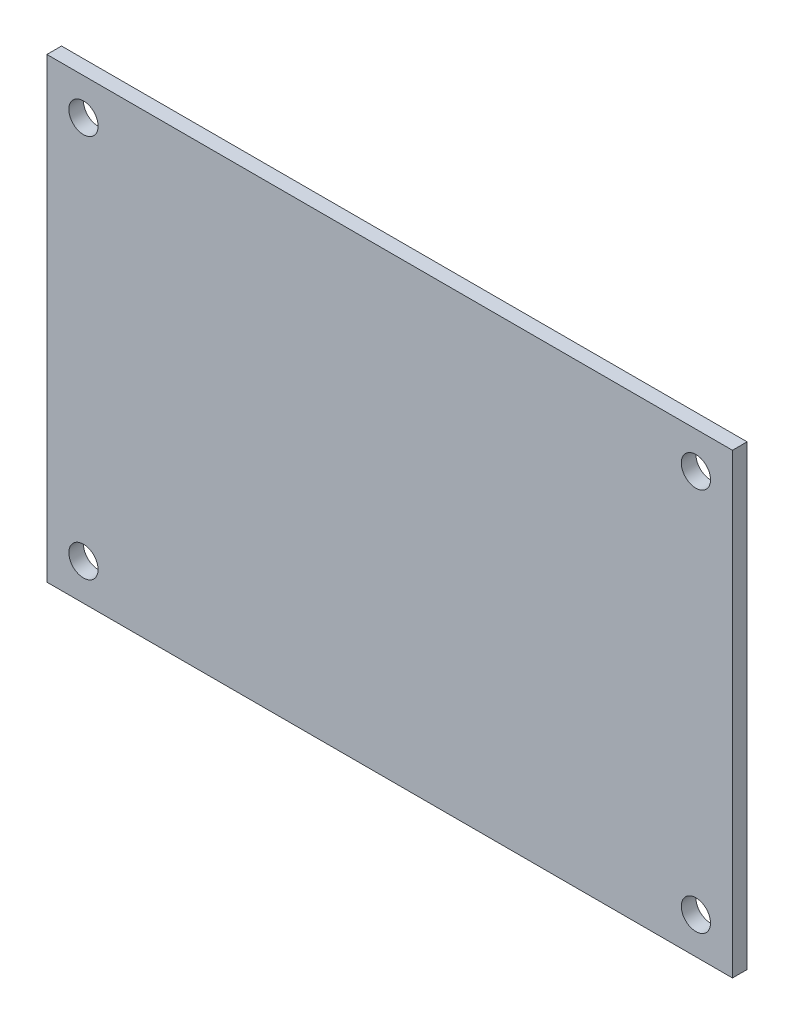
ISO-10303-21;
HEADER;
FILE_DESCRIPTION(('STEP AP214'),'2;1');
FILE_NAME('part.step','',(''),(''),'','','');
FILE_SCHEMA(('AUTOMOTIVE_DESIGN { 1 0 10303 214 1 1 1 1 }'));
ENDSEC;
DATA;
#1=APPLICATION_CONTEXT('core data for automotive mechanical design processes');
#2=APPLICATION_PROTOCOL_DEFINITION('international standard','automotive_design',2000,#1);
#3=PRODUCT_CONTEXT('',#1,'mechanical');
#4=PRODUCT('Part','Part','',(#3));
#5=PRODUCT_RELATED_PRODUCT_CATEGORY('part','',(#4));
#6=PRODUCT_DEFINITION_FORMATION('','',#4);
#7=PRODUCT_DEFINITION_CONTEXT('part definition',#1,'design');
#8=PRODUCT_DEFINITION('design','',#6,#7);
#9=PRODUCT_DEFINITION_SHAPE('','',#8);
#10=(LENGTH_UNIT() NAMED_UNIT(*) SI_UNIT(.MILLI.,.METRE.));
#11=(NAMED_UNIT(*) PLANE_ANGLE_UNIT() SI_UNIT($,.RADIAN.));
#12=(NAMED_UNIT(*) SI_UNIT($,.STERADIAN.) SOLID_ANGLE_UNIT());
#13=UNCERTAINTY_MEASURE_WITH_UNIT(LENGTH_MEASURE(1.E-05),#10,'distance_accuracy_value','');
#14=(GEOMETRIC_REPRESENTATION_CONTEXT(3) GLOBAL_UNCERTAINTY_ASSIGNED_CONTEXT((#13)) GLOBAL_UNIT_ASSIGNED_CONTEXT((#10,
#11,#12)) REPRESENTATION_CONTEXT('',''));
#15=CARTESIAN_POINT('',(0.,0.,0.));
#16=DIRECTION('',(0.,0.,1.));
#17=DIRECTION('',(1.,0.,0.));
#18=AXIS2_PLACEMENT_3D('',#15,#16,#17);
#19=CARTESIAN_POINT('',(-37.5,25.,1.6));
#20=DIRECTION('',(1.,0.,0.));
#21=DIRECTION('',(0.,1.,0.));
#22=AXIS2_PLACEMENT_3D('',#19,#20,#21);
#23=PLANE('',#22);
#24=DIRECTION('',(0.,-1.,0.));
#25=VECTOR('',#24,1.);
#26=CARTESIAN_POINT('',(-37.5,25.,0.));
#27=LINE('',#26,#25);
#28=CARTESIAN_POINT('',(-37.5,25.,0.));
#29=VERTEX_POINT('',#28);
#30=CARTESIAN_POINT('',(-37.5,-25.,0.));
#31=VERTEX_POINT('',#30);
#32=EDGE_CURVE('E96',#29,#31,#27,.T.);
#33=ORIENTED_EDGE('',*,*,#32,.T.);
#34=DIRECTION('',(0.,0.,-1.));
#35=VECTOR('',#34,1.);
#36=CARTESIAN_POINT('',(-37.5,-25.,1.6));
#37=LINE('',#36,#35);
#38=CARTESIAN_POINT('',(-37.5,-25.,1.6));
#39=VERTEX_POINT('',#38);
#40=EDGE_CURVE('E11',#39,#31,#37,.T.);
#41=ORIENTED_EDGE('',*,*,#40,.F.);
#42=DIRECTION('',(0.,-1.,0.));
#43=VECTOR('',#42,1.);
#44=CARTESIAN_POINT('',(-37.5,25.,1.6));
#45=LINE('',#44,#43);
#46=CARTESIAN_POINT('',(-37.5,25.,1.6));
#47=VERTEX_POINT('',#46);
#48=EDGE_CURVE('E84',#47,#39,#45,.T.);
#49=ORIENTED_EDGE('',*,*,#48,.F.);
#50=DIRECTION('',(0.,0.,-1.));
#51=VECTOR('',#50,1.);
#52=CARTESIAN_POINT('',(-37.5,25.,1.6));
#53=LINE('',#52,#51);
#54=EDGE_CURVE('E92',#47,#29,#53,.T.);
#55=ORIENTED_EDGE('',*,*,#54,.T.);
#56=EDGE_LOOP('',(#33,#41,#49,#55));
#57=FACE_BOUND('',#56,.T.);
#58=ADVANCED_FACE('F33',(#57),#23,.F.);
#59=CARTESIAN_POINT('',(-37.5,-25.,1.6));
#60=DIRECTION('',(0.,1.,0.));
#61=DIRECTION('',(0.,0.,1.));
#62=AXIS2_PLACEMENT_3D('',#59,#60,#61);
#63=PLANE('',#62);
#64=DIRECTION('',(1.,0.,0.));
#65=VECTOR('',#64,1.);
#66=CARTESIAN_POINT('',(-37.5,-25.,0.));
#67=LINE('',#66,#65);
#68=CARTESIAN_POINT('',(37.5,-25.,0.));
#69=VERTEX_POINT('',#68);
#70=EDGE_CURVE('E88',#31,#69,#67,.T.);
#71=ORIENTED_EDGE('',*,*,#70,.T.);
#72=DIRECTION('',(0.,0.,-1.));
#73=VECTOR('',#72,1.);
#74=CARTESIAN_POINT('',(37.5,-25.,1.6));
#75=LINE('',#74,#73);
#76=CARTESIAN_POINT('',(37.5,-25.,1.6));
#77=VERTEX_POINT('',#76);
#78=EDGE_CURVE('E41',#77,#69,#75,.T.);
#79=ORIENTED_EDGE('',*,*,#78,.F.);
#80=DIRECTION('',(1.,0.,0.));
#81=VECTOR('',#80,1.);
#82=CARTESIAN_POINT('',(-37.5,-25.,1.6));
#83=LINE('',#82,#81);
#84=EDGE_CURVE('E79',#39,#77,#83,.T.);
#85=ORIENTED_EDGE('',*,*,#84,.F.);
#86=ORIENTED_EDGE('',*,*,#40,.T.);
#87=EDGE_LOOP('',(#71,#79,#85,#86));
#88=FACE_BOUND('',#87,.T.);
#89=ADVANCED_FACE('F87',(#88),#63,.F.);
#90=CARTESIAN_POINT('',(37.5,25.,1.6));
#91=DIRECTION('',(-1.,0.,0.));
#92=DIRECTION('',(0.,0.,1.));
#93=AXIS2_PLACEMENT_3D('',#90,#91,#92);
#94=PLANE('',#93);
#95=DIRECTION('',(0.,1.,0.));
#96=VECTOR('',#95,1.);
#97=CARTESIAN_POINT('',(37.5,25.,0.));
#98=LINE('',#97,#96);
#99=CARTESIAN_POINT('',(37.5,25.,0.));
#100=VERTEX_POINT('',#99);
#101=EDGE_CURVE('E66',#69,#100,#98,.T.);
#102=ORIENTED_EDGE('',*,*,#101,.T.);
#103=DIRECTION('',(0.,0.,-1.));
#104=VECTOR('',#103,1.);
#105=CARTESIAN_POINT('',(37.5,25.,1.6));
#106=LINE('',#105,#104);
#107=CARTESIAN_POINT('',(37.5,25.,1.6));
#108=VERTEX_POINT('',#107);
#109=EDGE_CURVE('E89',#108,#100,#106,.T.);
#110=ORIENTED_EDGE('',*,*,#109,.F.);
#111=DIRECTION('',(0.,1.,0.));
#112=VECTOR('',#111,1.);
#113=CARTESIAN_POINT('',(37.5,25.,1.6));
#114=LINE('',#113,#112);
#115=EDGE_CURVE('E82',#77,#108,#114,.T.);
#116=ORIENTED_EDGE('',*,*,#115,.F.);
#117=ORIENTED_EDGE('',*,*,#78,.T.);
#118=EDGE_LOOP('',(#102,#110,#116,#117));
#119=FACE_BOUND('',#118,.T.);
#120=ADVANCED_FACE('F90',(#119),#94,.F.);
#121=CARTESIAN_POINT('',(-37.5,25.,1.6));
#122=DIRECTION('',(0.,-1.,0.));
#123=DIRECTION('',(0.,0.,-1.));
#124=AXIS2_PLACEMENT_3D('',#121,#122,#123);
#125=PLANE('',#124);
#126=DIRECTION('',(-1.,0.,0.));
#127=VECTOR('',#126,1.);
#128=CARTESIAN_POINT('',(-37.5,25.,0.));
#129=LINE('',#128,#127);
#130=EDGE_CURVE('E72',#100,#29,#129,.T.);
#131=ORIENTED_EDGE('',*,*,#130,.T.);
#132=ORIENTED_EDGE('',*,*,#54,.F.);
#133=DIRECTION('',(-1.,0.,0.));
#134=VECTOR('',#133,1.);
#135=CARTESIAN_POINT('',(-37.5,25.,1.6));
#136=LINE('',#135,#134);
#137=EDGE_CURVE('E49',#108,#47,#136,.T.);
#138=ORIENTED_EDGE('',*,*,#137,.F.);
#139=ORIENTED_EDGE('',*,*,#109,.T.);
#140=EDGE_LOOP('',(#131,#132,#138,#139));
#141=FACE_BOUND('',#140,.T.);
#142=ADVANCED_FACE('F104',(#141),#125,.F.);
#143=CARTESIAN_POINT('',(0.,0.,1.6));
#144=DIRECTION('',(0.,0.,1.));
#145=DIRECTION('',(1.,0.,0.));
#146=AXIS2_PLACEMENT_3D('',#143,#144,#145);
#147=PLANE('',#146);
#148=CARTESIAN_POINT('',(33.5,21.,1.6));
#149=DIRECTION('',(0.,0.,1.));
#150=DIRECTION('',(1.,0.,0.));
#151=AXIS2_PLACEMENT_3D('',#148,#149,#150);
#152=CIRCLE('',#151,1.6);
#153=CARTESIAN_POINT('',(35.1,21.,1.6));
#154=VERTEX_POINT('',#153);
#155=EDGE_CURVE('E128',#154,#154,#152,.T.);
#156=ORIENTED_EDGE('',*,*,#155,.F.);
#157=EDGE_LOOP('',(#156));
#158=FACE_BOUND('',#157,.T.);
#159=CARTESIAN_POINT('',(33.5,-21.,1.6));
#160=DIRECTION('',(0.,0.,1.));
#161=DIRECTION('',(1.,0.,0.));
#162=AXIS2_PLACEMENT_3D('',#159,#160,#161);
#163=CIRCLE('',#162,1.6);
#164=CARTESIAN_POINT('',(35.1,-21.,1.6));
#165=VERTEX_POINT('',#164);
#166=EDGE_CURVE('E122',#165,#165,#163,.T.);
#167=ORIENTED_EDGE('',*,*,#166,.F.);
#168=EDGE_LOOP('',(#167));
#169=FACE_BOUND('',#168,.T.);
#170=CARTESIAN_POINT('',(-33.5,-21.,1.6));
#171=DIRECTION('',(0.,0.,1.));
#172=DIRECTION('',(1.,0.,0.));
#173=AXIS2_PLACEMENT_3D('',#170,#171,#172);
#174=CIRCLE('',#173,1.6);
#175=CARTESIAN_POINT('',(-31.9,-21.,1.6));
#176=VERTEX_POINT('',#175);
#177=EDGE_CURVE('E116',#176,#176,#174,.T.);
#178=ORIENTED_EDGE('',*,*,#177,.F.);
#179=EDGE_LOOP('',(#178));
#180=FACE_BOUND('',#179,.T.);
#181=CARTESIAN_POINT('',(-33.5,21.,1.6));
#182=DIRECTION('',(0.,0.,1.));
#183=DIRECTION('',(1.,0.,0.));
#184=AXIS2_PLACEMENT_3D('',#181,#182,#183);
#185=CIRCLE('',#184,1.6);
#186=CARTESIAN_POINT('',(-31.9,21.,1.6));
#187=VERTEX_POINT('',#186);
#188=EDGE_CURVE('E110',#187,#187,#185,.T.);
#189=ORIENTED_EDGE('',*,*,#188,.F.);
#190=EDGE_LOOP('',(#189));
#191=FACE_BOUND('',#190,.T.);
#192=ORIENTED_EDGE('',*,*,#48,.T.);
#193=ORIENTED_EDGE('',*,*,#84,.T.);
#194=ORIENTED_EDGE('',*,*,#115,.T.);
#195=ORIENTED_EDGE('',*,*,#137,.T.);
#196=EDGE_LOOP('',(#192,#193,#194,#195));
#197=FACE_BOUND('',#196,.T.);
#198=ADVANCED_FACE('F80',(#158,#169,#180,#191,#197),#147,.T.);
#199=CARTESIAN_POINT('',(0.,0.,0.));
#200=DIRECTION('',(0.,0.,1.));
#201=DIRECTION('',(1.,0.,0.));
#202=AXIS2_PLACEMENT_3D('',#199,#200,#201);
#203=PLANE('',#202);
#204=CARTESIAN_POINT('',(33.5,21.,0.));
#205=DIRECTION('',(0.,0.,1.));
#206=DIRECTION('',(1.,0.,0.));
#207=AXIS2_PLACEMENT_3D('',#204,#205,#206);
#208=CIRCLE('',#207,1.6);
#209=CARTESIAN_POINT('',(35.1,21.,0.));
#210=VERTEX_POINT('',#209);
#211=EDGE_CURVE('E113',#210,#210,#208,.T.);
#212=ORIENTED_EDGE('',*,*,#211,.T.);
#213=EDGE_LOOP('',(#212));
#214=FACE_BOUND('',#213,.T.);
#215=CARTESIAN_POINT('',(33.5,-21.,0.));
#216=DIRECTION('',(0.,0.,1.));
#217=DIRECTION('',(1.,0.,0.));
#218=AXIS2_PLACEMENT_3D('',#215,#216,#217);
#219=CIRCLE('',#218,1.6);
#220=CARTESIAN_POINT('',(35.1,-21.,0.));
#221=VERTEX_POINT('',#220);
#222=EDGE_CURVE('E125',#221,#221,#219,.T.);
#223=ORIENTED_EDGE('',*,*,#222,.T.);
#224=EDGE_LOOP('',(#223));
#225=FACE_BOUND('',#224,.T.);
#226=CARTESIAN_POINT('',(-33.5,-21.,0.));
#227=DIRECTION('',(0.,0.,1.));
#228=DIRECTION('',(1.,0.,0.));
#229=AXIS2_PLACEMENT_3D('',#226,#227,#228);
#230=CIRCLE('',#229,1.6);
#231=CARTESIAN_POINT('',(-31.9,-21.,0.));
#232=VERTEX_POINT('',#231);
#233=EDGE_CURVE('E119',#232,#232,#230,.T.);
#234=ORIENTED_EDGE('',*,*,#233,.T.);
#235=EDGE_LOOP('',(#234));
#236=FACE_BOUND('',#235,.T.);
#237=CARTESIAN_POINT('',(-33.5,21.,0.));
#238=DIRECTION('',(0.,0.,1.));
#239=DIRECTION('',(1.,0.,0.));
#240=AXIS2_PLACEMENT_3D('',#237,#238,#239);
#241=CIRCLE('',#240,1.6);
#242=CARTESIAN_POINT('',(-31.9,21.,0.));
#243=VERTEX_POINT('',#242);
#244=EDGE_CURVE('E99',#243,#243,#241,.T.);
#245=ORIENTED_EDGE('',*,*,#244,.T.);
#246=EDGE_LOOP('',(#245));
#247=FACE_BOUND('',#246,.T.);
#248=ORIENTED_EDGE('',*,*,#32,.F.);
#249=ORIENTED_EDGE('',*,*,#130,.F.);
#250=ORIENTED_EDGE('',*,*,#101,.F.);
#251=ORIENTED_EDGE('',*,*,#70,.F.);
#252=EDGE_LOOP('',(#248,#249,#250,#251));
#253=FACE_BOUND('',#252,.T.);
#254=ADVANCED_FACE('F107',(#214,#225,#236,#247,#253),#203,.F.);
#255=CARTESIAN_POINT('',(-33.5,21.,0.));
#256=DIRECTION('',(0.,0.,1.));
#257=DIRECTION('',(1.,0.,0.));
#258=AXIS2_PLACEMENT_3D('',#255,#256,#257);
#259=CYLINDRICAL_SURFACE('',#258,1.6);
#260=ORIENTED_EDGE('',*,*,#244,.F.);
#261=EDGE_LOOP('',(#260));
#262=FACE_BOUND('',#261,.T.);
#263=ORIENTED_EDGE('',*,*,#188,.T.);
#264=EDGE_LOOP('',(#263));
#265=FACE_BOUND('',#264,.T.);
#266=ADVANCED_FACE('F152',(#262,#265),#259,.F.);
#267=CARTESIAN_POINT('',(-33.5,-21.,0.));
#268=DIRECTION('',(0.,0.,1.));
#269=DIRECTION('',(1.,0.,0.));
#270=AXIS2_PLACEMENT_3D('',#267,#268,#269);
#271=CYLINDRICAL_SURFACE('',#270,1.6);
#272=ORIENTED_EDGE('',*,*,#233,.F.);
#273=EDGE_LOOP('',(#272));
#274=FACE_BOUND('',#273,.T.);
#275=ORIENTED_EDGE('',*,*,#177,.T.);
#276=EDGE_LOOP('',(#275));
#277=FACE_BOUND('',#276,.T.);
#278=ADVANCED_FACE('F154',(#274,#277),#271,.F.);
#279=CARTESIAN_POINT('',(33.5,-21.,0.));
#280=DIRECTION('',(0.,0.,1.));
#281=DIRECTION('',(1.,0.,0.));
#282=AXIS2_PLACEMENT_3D('',#279,#280,#281);
#283=CYLINDRICAL_SURFACE('',#282,1.6);
#284=ORIENTED_EDGE('',*,*,#222,.F.);
#285=EDGE_LOOP('',(#284));
#286=FACE_BOUND('',#285,.T.);
#287=ORIENTED_EDGE('',*,*,#166,.T.);
#288=EDGE_LOOP('',(#287));
#289=FACE_BOUND('',#288,.T.);
#290=ADVANCED_FACE('F139',(#286,#289),#283,.F.);
#291=CARTESIAN_POINT('',(33.5,21.,0.));
#292=DIRECTION('',(0.,0.,1.));
#293=DIRECTION('',(1.,0.,0.));
#294=AXIS2_PLACEMENT_3D('',#291,#292,#293);
#295=CYLINDRICAL_SURFACE('',#294,1.6);
#296=ORIENTED_EDGE('',*,*,#211,.F.);
#297=EDGE_LOOP('',(#296));
#298=FACE_BOUND('',#297,.T.);
#299=ORIENTED_EDGE('',*,*,#155,.T.);
#300=EDGE_LOOP('',(#299));
#301=FACE_BOUND('',#300,.T.);
#302=ADVANCED_FACE('F136',(#298,#301),#295,.F.);
#303=CLOSED_SHELL('',(#58,#89,#120,#142,#198,#254,#266,#278,#290,#302));
#304=MANIFOLD_SOLID_BREP('B2',#303);
#305=ADVANCED_BREP_SHAPE_REPRESENTATION('',(#18,#304),#14);
#306=SHAPE_DEFINITION_REPRESENTATION(#9,#305);
ENDSEC;
END-ISO-10303-21;
